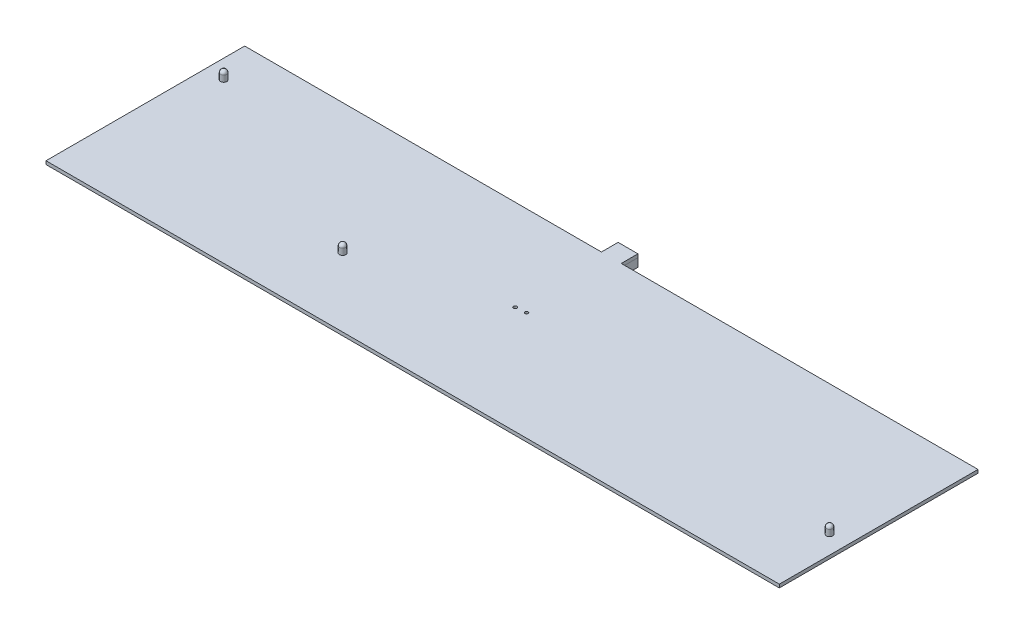
ISO-10303-21;
HEADER;
FILE_DESCRIPTION(('STEP AP214'),'2;1');
FILE_NAME('part.step','',(''),(''),'','','');
FILE_SCHEMA(('AUTOMOTIVE_DESIGN { 1 0 10303 214 1 1 1 1 }'));
ENDSEC;
DATA;
#1=APPLICATION_CONTEXT('core data for automotive mechanical design processes');
#2=APPLICATION_PROTOCOL_DEFINITION('international standard','automotive_design',2000,#1);
#3=PRODUCT_CONTEXT('',#1,'mechanical');
#4=PRODUCT('Part','Part','',(#3));
#5=PRODUCT_RELATED_PRODUCT_CATEGORY('part','',(#4));
#6=PRODUCT_DEFINITION_FORMATION('','',#4);
#7=PRODUCT_DEFINITION_CONTEXT('part definition',#1,'design');
#8=PRODUCT_DEFINITION('design','',#6,#7);
#9=PRODUCT_DEFINITION_SHAPE('','',#8);
#10=(LENGTH_UNIT() NAMED_UNIT(*) SI_UNIT(.MILLI.,.METRE.));
#11=(NAMED_UNIT(*) PLANE_ANGLE_UNIT() SI_UNIT($,.RADIAN.));
#12=(NAMED_UNIT(*) SI_UNIT($,.STERADIAN.) SOLID_ANGLE_UNIT());
#13=UNCERTAINTY_MEASURE_WITH_UNIT(LENGTH_MEASURE(1.E-05),#10,'distance_accuracy_value','');
#14=(GEOMETRIC_REPRESENTATION_CONTEXT(3) GLOBAL_UNCERTAINTY_ASSIGNED_CONTEXT((#13)) GLOBAL_UNIT_ASSIGNED_CONTEXT((#10,
#11,#12)) REPRESENTATION_CONTEXT('',''));
#15=CARTESIAN_POINT('',(0.,0.,0.));
#16=DIRECTION('',(0.,0.,1.));
#17=DIRECTION('',(1.,0.,0.));
#18=AXIS2_PLACEMENT_3D('',#15,#16,#17);
#19=CARTESIAN_POINT('',(4.74999999999994,-5.6,-55.6));
#20=DIRECTION('',(-1.,0.,0.));
#21=DIRECTION('',(0.,0.,1.));
#22=AXIS2_PLACEMENT_3D('',#19,#20,#21);
#23=PLANE('',#22);
#24=DIRECTION('',(0.,0.,1.));
#25=VECTOR('',#24,1.);
#26=CARTESIAN_POINT('',(4.74999999999994,-1.6,-55.6));
#27=LINE('',#26,#25);
#28=CARTESIAN_POINT('',(4.74999999999994,-1.6,-55.6));
#29=VERTEX_POINT('',#28);
#30=CARTESIAN_POINT('',(4.74999999999994,-1.6,-47.6));
#31=VERTEX_POINT('',#30);
#32=EDGE_CURVE('E109',#29,#31,#27,.T.);
#33=ORIENTED_EDGE('',*,*,#32,.T.);
#34=DIRECTION('',(0.,1.,0.));
#35=VECTOR('',#34,1.);
#36=CARTESIAN_POINT('',(4.74999999999994,-5.6,-47.6));
#37=LINE('',#36,#35);
#38=CARTESIAN_POINT('',(4.74999999999994,-5.6,-47.6));
#39=VERTEX_POINT('',#38);
#40=EDGE_CURVE('E12',#39,#31,#37,.T.);
#41=ORIENTED_EDGE('',*,*,#40,.F.);
#42=DIRECTION('',(0.,0.,1.));
#43=VECTOR('',#42,1.);
#44=CARTESIAN_POINT('',(4.74999999999994,-5.6,-55.6));
#45=LINE('',#44,#43);
#46=CARTESIAN_POINT('',(4.74999999999994,-5.6,-55.6));
#47=VERTEX_POINT('',#46);
#48=EDGE_CURVE('E97',#47,#39,#45,.T.);
#49=ORIENTED_EDGE('',*,*,#48,.F.);
#50=DIRECTION('',(0.,1.,0.));
#51=VECTOR('',#50,1.);
#52=CARTESIAN_POINT('',(4.74999999999994,-5.6,-55.6));
#53=LINE('',#52,#51);
#54=EDGE_CURVE('E105',#47,#29,#53,.T.);
#55=ORIENTED_EDGE('',*,*,#54,.T.);
#56=EDGE_LOOP('',(#33,#41,#49,#55));
#57=FACE_BOUND('',#56,.T.);
#58=ADVANCED_FACE('F46',(#57),#23,.F.);
#59=CARTESIAN_POINT('',(4.74999999999994,-5.6,-47.6));
#60=DIRECTION('',(0.,0.,-1.));
#61=DIRECTION('',(0.,1.,0.));
#62=AXIS2_PLACEMENT_3D('',#59,#60,#61);
#63=PLANE('',#62);
#64=DIRECTION('',(-1.,0.,0.));
#65=VECTOR('',#64,1.);
#66=CARTESIAN_POINT('',(4.74999999999994,-1.6,-47.6));
#67=LINE('',#66,#65);
#68=CARTESIAN_POINT('',(-4.75000000000006,-1.6,-47.6));
#69=VERTEX_POINT('',#68);
#70=EDGE_CURVE('E101',#31,#69,#67,.T.);
#71=ORIENTED_EDGE('',*,*,#70,.T.);
#72=DIRECTION('',(0.,1.,0.));
#73=VECTOR('',#72,1.);
#74=CARTESIAN_POINT('',(-4.75000000000006,-5.6,-47.6));
#75=LINE('',#74,#73);
#76=CARTESIAN_POINT('',(-4.75000000000006,-5.6,-47.6));
#77=VERTEX_POINT('',#76);
#78=EDGE_CURVE('E54',#77,#69,#75,.T.);
#79=ORIENTED_EDGE('',*,*,#78,.F.);
#80=DIRECTION('',(-1.,0.,0.));
#81=VECTOR('',#80,1.);
#82=CARTESIAN_POINT('',(4.74999999999994,-5.6,-47.6));
#83=LINE('',#82,#81);
#84=EDGE_CURVE('E92',#39,#77,#83,.T.);
#85=ORIENTED_EDGE('',*,*,#84,.F.);
#86=ORIENTED_EDGE('',*,*,#40,.T.);
#87=EDGE_LOOP('',(#71,#79,#85,#86));
#88=FACE_BOUND('',#87,.T.);
#89=ADVANCED_FACE('F100',(#88),#63,.F.);
#90=CARTESIAN_POINT('',(-4.75000000000006,-5.6,-47.6));
#91=DIRECTION('',(1.,0.,0.));
#92=DIRECTION('',(0.,0.,-1.));
#93=AXIS2_PLACEMENT_3D('',#90,#91,#92);
#94=PLANE('',#93);
#95=DIRECTION('',(0.,0.,-1.));
#96=VECTOR('',#95,1.);
#97=CARTESIAN_POINT('',(-4.75000000000006,-1.6,-47.6));
#98=LINE('',#97,#96);
#99=CARTESIAN_POINT('',(-4.75000000000006,-1.6,-55.6));
#100=VERTEX_POINT('',#99);
#101=EDGE_CURVE('E79',#69,#100,#98,.T.);
#102=ORIENTED_EDGE('',*,*,#101,.T.);
#103=DIRECTION('',(0.,1.,0.));
#104=VECTOR('',#103,1.);
#105=CARTESIAN_POINT('',(-4.75000000000006,-5.6,-55.6));
#106=LINE('',#105,#104);
#107=CARTESIAN_POINT('',(-4.75000000000006,-5.6,-55.6));
#108=VERTEX_POINT('',#107);
#109=EDGE_CURVE('E102',#108,#100,#106,.T.);
#110=ORIENTED_EDGE('',*,*,#109,.F.);
#111=DIRECTION('',(0.,0.,-1.));
#112=VECTOR('',#111,1.);
#113=CARTESIAN_POINT('',(-4.75000000000006,-5.6,-47.6));
#114=LINE('',#113,#112);
#115=EDGE_CURVE('E95',#77,#108,#114,.T.);
#116=ORIENTED_EDGE('',*,*,#115,.F.);
#117=ORIENTED_EDGE('',*,*,#78,.T.);
#118=EDGE_LOOP('',(#102,#110,#116,#117));
#119=FACE_BOUND('',#118,.T.);
#120=ADVANCED_FACE('F103',(#119),#94,.F.);
#121=CARTESIAN_POINT('',(-4.75000000000006,-5.6,-55.6));
#122=DIRECTION('',(0.,0.,1.));
#123=DIRECTION('',(0.,-1.,0.));
#124=AXIS2_PLACEMENT_3D('',#121,#122,#123);
#125=PLANE('',#124);
#126=DIRECTION('',(1.,0.,0.));
#127=VECTOR('',#126,1.);
#128=CARTESIAN_POINT('',(-4.75000000000006,-1.6,-55.6));
#129=LINE('',#128,#127);
#130=EDGE_CURVE('E85',#100,#29,#129,.T.);
#131=ORIENTED_EDGE('',*,*,#130,.T.);
#132=ORIENTED_EDGE('',*,*,#54,.F.);
#133=DIRECTION('',(1.,0.,0.));
#134=VECTOR('',#133,1.);
#135=CARTESIAN_POINT('',(-4.75000000000006,-5.6,-55.6));
#136=LINE('',#135,#134);
#137=EDGE_CURVE('E62',#108,#47,#136,.T.);
#138=ORIENTED_EDGE('',*,*,#137,.F.);
#139=ORIENTED_EDGE('',*,*,#109,.T.);
#140=EDGE_LOOP('',(#131,#132,#138,#139));
#141=FACE_BOUND('',#140,.T.);
#142=ADVANCED_FACE('F116',(#141),#125,.F.);
#143=CARTESIAN_POINT('',(0.,-5.6,0.));
#144=DIRECTION('',(0.,-1.,0.));
#145=DIRECTION('',(0.,0.,-1.));
#146=AXIS2_PLACEMENT_3D('',#143,#144,#145);
#147=PLANE('',#146);
#148=ORIENTED_EDGE('',*,*,#48,.T.);
#149=ORIENTED_EDGE('',*,*,#84,.T.);
#150=ORIENTED_EDGE('',*,*,#115,.T.);
#151=ORIENTED_EDGE('',*,*,#137,.T.);
#152=EDGE_LOOP('',(#148,#149,#150,#151));
#153=FACE_BOUND('',#152,.T.);
#154=ADVANCED_FACE('F93',(#153),#147,.T.);
#155=CARTESIAN_POINT('',(0.,-1.6,0.));
#156=DIRECTION('',(0.,-1.,0.));
#157=DIRECTION('',(0.,0.,-1.));
#158=AXIS2_PLACEMENT_3D('',#155,#156,#157);
#159=PLANE('',#158);
#160=ORIENTED_EDGE('',*,*,#32,.F.);
#161=ORIENTED_EDGE('',*,*,#130,.F.);
#162=ORIENTED_EDGE('',*,*,#101,.F.);
#163=ORIENTED_EDGE('',*,*,#70,.F.);
#164=EDGE_LOOP('',(#160,#161,#162,#163));
#165=FACE_BOUND('',#164,.T.);
#166=ADVANCED_FACE('F119',(#165),#159,.F.);
#167=CLOSED_SHELL('',(#58,#89,#120,#142,#154,#166));
#168=MANIFOLD_SOLID_BREP('B2',#167);
#169=CARTESIAN_POINT('',(4.74999999999994,-1.6,-47.6));
#170=DIRECTION('',(0.,0.,-1.));
#171=DIRECTION('',(-1.,0.,0.));
#172=AXIS2_PLACEMENT_3D('',#169,#170,#171);
#173=PLANE('',#172);
#174=DIRECTION('',(-1.,0.,0.));
#175=VECTOR('',#174,1.);
#176=CARTESIAN_POINT('',(4.74999999999994,0.,-47.6));
#177=LINE('',#176,#175);
#178=CARTESIAN_POINT('',(175.7,0.,-47.6));
#179=VERTEX_POINT('',#178);
#180=CARTESIAN_POINT('',(4.74999999999994,0.,-47.6));
#181=VERTEX_POINT('',#180);
#182=EDGE_CURVE('E270',#179,#181,#177,.T.);
#183=ORIENTED_EDGE('',*,*,#182,.F.);
#184=DIRECTION('',(0.,1.,0.));
#185=VECTOR('',#184,1.);
#186=CARTESIAN_POINT('',(175.7,-1.6,-47.6));
#187=LINE('',#186,#185);
#188=CARTESIAN_POINT('',(175.7,-1.6,-47.6));
#189=VERTEX_POINT('',#188);
#190=EDGE_CURVE('E44',#189,#179,#187,.T.);
#191=ORIENTED_EDGE('',*,*,#190,.F.);
#192=DIRECTION('',(-1.,0.,0.));
#193=VECTOR('',#192,1.);
#194=CARTESIAN_POINT('',(4.74999999999994,-1.6,-47.6));
#195=LINE('',#194,#193);
#196=CARTESIAN_POINT('',(4.74999999999994,-1.6,-47.6));
#197=VERTEX_POINT('',#196);
#198=EDGE_CURVE('E291',#189,#197,#195,.T.);
#199=ORIENTED_EDGE('',*,*,#198,.T.);
#200=DIRECTION('',(0.,1.,0.));
#201=VECTOR('',#200,1.);
#202=CARTESIAN_POINT('',(4.74999999999994,-1.6,-47.6));
#203=LINE('',#202,#201);
#204=EDGE_CURVE('E228',#197,#181,#203,.T.);
#205=ORIENTED_EDGE('',*,*,#204,.T.);
#206=EDGE_LOOP('',(#183,#191,#199,#205));
#207=FACE_BOUND('',#206,.T.);
#208=ADVANCED_FACE('F171',(#207),#173,.T.);
#209=CARTESIAN_POINT('',(175.7,-1.6,47.6));
#210=DIRECTION('',(1.,0.,0.));
#211=DIRECTION('',(0.,0.,-1.));
#212=AXIS2_PLACEMENT_3D('',#209,#210,#211);
#213=PLANE('',#212);
#214=DIRECTION('',(0.,0.,-1.));
#215=VECTOR('',#214,1.);
#216=CARTESIAN_POINT('',(175.7,0.,47.6));
#217=LINE('',#216,#215);
#218=CARTESIAN_POINT('',(175.7,0.,47.6));
#219=VERTEX_POINT('',#218);
#220=EDGE_CURVE('E289',#219,#179,#217,.T.);
#221=ORIENTED_EDGE('',*,*,#220,.F.);
#222=DIRECTION('',(0.,1.,0.));
#223=VECTOR('',#222,1.);
#224=CARTESIAN_POINT('',(175.7,-1.6,47.6));
#225=LINE('',#224,#223);
#226=CARTESIAN_POINT('',(175.7,-1.6,47.6));
#227=VERTEX_POINT('',#226);
#228=EDGE_CURVE('E181',#227,#219,#225,.T.);
#229=ORIENTED_EDGE('',*,*,#228,.F.);
#230=DIRECTION('',(0.,0.,-1.));
#231=VECTOR('',#230,1.);
#232=CARTESIAN_POINT('',(175.7,-1.6,47.6));
#233=LINE('',#232,#231);
#234=EDGE_CURVE('E260',#227,#189,#233,.T.);
#235=ORIENTED_EDGE('',*,*,#234,.T.);
#236=ORIENTED_EDGE('',*,*,#190,.T.);
#237=EDGE_LOOP('',(#221,#229,#235,#236));
#238=FACE_BOUND('',#237,.T.);
#239=ADVANCED_FACE('F349',(#238),#213,.T.);
#240=CARTESIAN_POINT('',(-175.7,-1.6,47.6));
#241=DIRECTION('',(0.,0.,1.));
#242=DIRECTION('',(1.,0.,0.));
#243=AXIS2_PLACEMENT_3D('',#240,#241,#242);
#244=PLANE('',#243);
#245=DIRECTION('',(1.,0.,0.));
#246=VECTOR('',#245,1.);
#247=CARTESIAN_POINT('',(-175.7,0.,47.6));
#248=LINE('',#247,#246);
#249=CARTESIAN_POINT('',(-175.7,0.,47.6));
#250=VERTEX_POINT('',#249);
#251=EDGE_CURVE('E247',#250,#219,#248,.T.);
#252=ORIENTED_EDGE('',*,*,#251,.F.);
#253=DIRECTION('',(0.,1.,0.));
#254=VECTOR('',#253,1.);
#255=CARTESIAN_POINT('',(-175.7,-1.6,47.6));
#256=LINE('',#255,#254);
#257=CARTESIAN_POINT('',(-175.7,-1.6,47.6));
#258=VERTEX_POINT('',#257);
#259=EDGE_CURVE('E242',#258,#250,#256,.T.);
#260=ORIENTED_EDGE('',*,*,#259,.F.);
#261=DIRECTION('',(1.,0.,0.));
#262=VECTOR('',#261,1.);
#263=CARTESIAN_POINT('',(-175.7,-1.6,47.6));
#264=LINE('',#263,#262);
#265=EDGE_CURVE('E245',#258,#227,#264,.T.);
#266=ORIENTED_EDGE('',*,*,#265,.T.);
#267=ORIENTED_EDGE('',*,*,#228,.T.);
#268=EDGE_LOOP('',(#252,#260,#266,#267));
#269=FACE_BOUND('',#268,.T.);
#270=ADVANCED_FACE('F244',(#269),#244,.T.);
#271=CARTESIAN_POINT('',(-175.7,-1.6,47.6));
#272=DIRECTION('',(-1.,0.,0.));
#273=DIRECTION('',(0.,0.,1.));
#274=AXIS2_PLACEMENT_3D('',#271,#272,#273);
#275=PLANE('',#274);
#276=DIRECTION('',(0.,0.,1.));
#277=VECTOR('',#276,1.);
#278=CARTESIAN_POINT('',(-175.7,0.,47.6));
#279=LINE('',#278,#277);
#280=CARTESIAN_POINT('',(-175.7,0.,-47.6));
#281=VERTEX_POINT('',#280);
#282=EDGE_CURVE('E286',#281,#250,#279,.T.);
#283=ORIENTED_EDGE('',*,*,#282,.F.);
#284=DIRECTION('',(0.,1.,0.));
#285=VECTOR('',#284,1.);
#286=CARTESIAN_POINT('',(-175.7,-1.6,-47.6));
#287=LINE('',#286,#285);
#288=CARTESIAN_POINT('',(-175.7,-1.6,-47.6));
#289=VERTEX_POINT('',#288);
#290=EDGE_CURVE('E252',#289,#281,#287,.T.);
#291=ORIENTED_EDGE('',*,*,#290,.F.);
#292=DIRECTION('',(0.,0.,1.));
#293=VECTOR('',#292,1.);
#294=CARTESIAN_POINT('',(-175.7,-1.6,47.6));
#295=LINE('',#294,#293);
#296=EDGE_CURVE('E258',#289,#258,#295,.T.);
#297=ORIENTED_EDGE('',*,*,#296,.T.);
#298=ORIENTED_EDGE('',*,*,#259,.T.);
#299=EDGE_LOOP('',(#283,#291,#297,#298));
#300=FACE_BOUND('',#299,.T.);
#301=ADVANCED_FACE('F262',(#300),#275,.T.);
#302=CARTESIAN_POINT('',(-175.7,-1.6,-47.6));
#303=DIRECTION('',(0.,0.,-1.));
#304=DIRECTION('',(-1.,0.,0.));
#305=AXIS2_PLACEMENT_3D('',#302,#303,#304);
#306=PLANE('',#305);
#307=DIRECTION('',(-1.,0.,0.));
#308=VECTOR('',#307,1.);
#309=CARTESIAN_POINT('',(-175.7,0.,-47.6));
#310=LINE('',#309,#308);
#311=CARTESIAN_POINT('',(-4.75000000000006,0.,-47.6));
#312=VERTEX_POINT('',#311);
#313=EDGE_CURVE('E283',#312,#281,#310,.T.);
#314=ORIENTED_EDGE('',*,*,#313,.F.);
#315=DIRECTION('',(0.,1.,0.));
#316=VECTOR('',#315,1.);
#317=CARTESIAN_POINT('',(-4.75000000000006,-1.6,-47.6));
#318=LINE('',#317,#316);
#319=CARTESIAN_POINT('',(-4.75000000000006,-1.6,-47.6));
#320=VERTEX_POINT('',#319);
#321=EDGE_CURVE('E295',#320,#312,#318,.T.);
#322=ORIENTED_EDGE('',*,*,#321,.F.);
#323=DIRECTION('',(-1.,0.,0.));
#324=VECTOR('',#323,1.);
#325=CARTESIAN_POINT('',(-175.7,-1.6,-47.6));
#326=LINE('',#325,#324);
#327=EDGE_CURVE('E263',#320,#289,#326,.T.);
#328=ORIENTED_EDGE('',*,*,#327,.T.);
#329=ORIENTED_EDGE('',*,*,#290,.T.);
#330=EDGE_LOOP('',(#314,#322,#328,#329));
#331=FACE_BOUND('',#330,.T.);
#332=ADVANCED_FACE('F363',(#331),#306,.T.);
#333=CARTESIAN_POINT('',(-4.75000000000006,-1.6,-47.6));
#334=DIRECTION('',(-1.,0.,0.));
#335=DIRECTION('',(0.,0.,1.));
#336=AXIS2_PLACEMENT_3D('',#333,#334,#335);
#337=PLANE('',#336);
#338=DIRECTION('',(0.,0.,1.));
#339=VECTOR('',#338,1.);
#340=CARTESIAN_POINT('',(-4.75000000000006,0.,-47.6));
#341=LINE('',#340,#339);
#342=CARTESIAN_POINT('',(-4.75000000000006,0.,-55.6));
#343=VERTEX_POINT('',#342);
#344=EDGE_CURVE('E280',#343,#312,#341,.T.);
#345=ORIENTED_EDGE('',*,*,#344,.F.);
#346=DIRECTION('',(0.,1.,0.));
#347=VECTOR('',#346,1.);
#348=CARTESIAN_POINT('',(-4.75000000000006,-1.6,-55.6));
#349=LINE('',#348,#347);
#350=CARTESIAN_POINT('',(-4.75000000000006,-1.6,-55.6));
#351=VERTEX_POINT('',#350);
#352=EDGE_CURVE('E297',#351,#343,#349,.T.);
#353=ORIENTED_EDGE('',*,*,#352,.F.);
#354=DIRECTION('',(0.,0.,1.));
#355=VECTOR('',#354,1.);
#356=CARTESIAN_POINT('',(-4.75000000000006,-1.6,-47.6));
#357=LINE('',#356,#355);
#358=EDGE_CURVE('E265',#351,#320,#357,.T.);
#359=ORIENTED_EDGE('',*,*,#358,.T.);
#360=ORIENTED_EDGE('',*,*,#321,.T.);
#361=EDGE_LOOP('',(#345,#353,#359,#360));
#362=FACE_BOUND('',#361,.T.);
#363=ADVANCED_FACE('F340',(#362),#337,.T.);
#364=CARTESIAN_POINT('',(-4.75000000000006,-1.6,-55.6));
#365=DIRECTION('',(0.,0.,-1.));
#366=DIRECTION('',(-1.,0.,0.));
#367=AXIS2_PLACEMENT_3D('',#364,#365,#366);
#368=PLANE('',#367);
#369=DIRECTION('',(-1.,0.,0.));
#370=VECTOR('',#369,1.);
#371=CARTESIAN_POINT('',(-4.75000000000006,0.,-55.6));
#372=LINE('',#371,#370);
#373=CARTESIAN_POINT('',(4.74999999999994,0.,-55.6));
#374=VERTEX_POINT('',#373);
#375=EDGE_CURVE('E277',#374,#343,#372,.T.);
#376=ORIENTED_EDGE('',*,*,#375,.F.);
#377=DIRECTION('',(0.,1.,0.));
#378=VECTOR('',#377,1.);
#379=CARTESIAN_POINT('',(4.74999999999994,-1.6,-55.6));
#380=LINE('',#379,#378);
#381=CARTESIAN_POINT('',(4.74999999999994,-1.6,-55.6));
#382=VERTEX_POINT('',#381);
#383=EDGE_CURVE('E299',#382,#374,#380,.T.);
#384=ORIENTED_EDGE('',*,*,#383,.F.);
#385=DIRECTION('',(-1.,0.,0.));
#386=VECTOR('',#385,1.);
#387=CARTESIAN_POINT('',(-4.75000000000006,-1.6,-55.6));
#388=LINE('',#387,#386);
#389=EDGE_CURVE('E334',#382,#351,#388,.T.);
#390=ORIENTED_EDGE('',*,*,#389,.T.);
#391=ORIENTED_EDGE('',*,*,#352,.T.);
#392=EDGE_LOOP('',(#376,#384,#390,#391));
#393=FACE_BOUND('',#392,.T.);
#394=ADVANCED_FACE('F345',(#393),#368,.T.);
#395=CARTESIAN_POINT('',(4.74999999999994,-1.6,-47.6));
#396=DIRECTION('',(1.,0.,0.));
#397=DIRECTION('',(0.,0.,-1.));
#398=AXIS2_PLACEMENT_3D('',#395,#396,#397);
#399=PLANE('',#398);
#400=DIRECTION('',(0.,0.,-1.));
#401=VECTOR('',#400,1.);
#402=CARTESIAN_POINT('',(4.74999999999994,0.,-47.6));
#403=LINE('',#402,#401);
#404=EDGE_CURVE('E273',#181,#374,#403,.T.);
#405=ORIENTED_EDGE('',*,*,#404,.F.);
#406=ORIENTED_EDGE('',*,*,#204,.F.);
#407=DIRECTION('',(0.,0.,-1.));
#408=VECTOR('',#407,1.);
#409=CARTESIAN_POINT('',(4.74999999999994,-1.6,-47.6));
#410=LINE('',#409,#408);
#411=EDGE_CURVE('E332',#197,#382,#410,.T.);
#412=ORIENTED_EDGE('',*,*,#411,.T.);
#413=ORIENTED_EDGE('',*,*,#383,.T.);
#414=EDGE_LOOP('',(#405,#406,#412,#413));
#415=FACE_BOUND('',#414,.T.);
#416=ADVANCED_FACE('F346',(#415),#399,.T.);
#417=CARTESIAN_POINT('',(0.,-1.6,0.));
#418=DIRECTION('',(0.,1.,0.));
#419=DIRECTION('',(0.,0.,1.));
#420=AXIS2_PLACEMENT_3D('',#417,#418,#419);
#421=PLANE('',#420);
#422=CARTESIAN_POINT('',(-2.5,-1.6,-4.));
#423=DIRECTION('',(0.,1.,0.));
#424=DIRECTION('',(0.,0.,1.));
#425=AXIS2_PLACEMENT_3D('',#422,#423,#424);
#426=CIRCLE('',#425,0.814910184363254);
#427=CARTESIAN_POINT('',(-2.5,-1.6,-3.18508981563675));
#428=VERTEX_POINT('',#427);
#429=EDGE_CURVE('E321',#428,#428,#426,.T.);
#430=ORIENTED_EDGE('',*,*,#429,.T.);
#431=EDGE_LOOP('',(#430));
#432=FACE_BOUND('',#431,.T.);
#433=CARTESIAN_POINT('',(2.5,-1.6,-4.5));
#434=DIRECTION('',(0.,1.,0.));
#435=DIRECTION('',(0.,0.,1.));
#436=AXIS2_PLACEMENT_3D('',#433,#434,#435);
#437=CIRCLE('',#436,0.733267679987911);
#438=CARTESIAN_POINT('',(2.5,-1.6,-3.76673232001209));
#439=VERTEX_POINT('',#438);
#440=EDGE_CURVE('E274',#439,#439,#437,.T.);
#441=ORIENTED_EDGE('',*,*,#440,.T.);
#442=EDGE_LOOP('',(#441));
#443=FACE_BOUND('',#442,.T.);
#444=ORIENTED_EDGE('',*,*,#198,.F.);
#445=ORIENTED_EDGE('',*,*,#234,.F.);
#446=ORIENTED_EDGE('',*,*,#265,.F.);
#447=ORIENTED_EDGE('',*,*,#296,.F.);
#448=ORIENTED_EDGE('',*,*,#327,.F.);
#449=ORIENTED_EDGE('',*,*,#358,.F.);
#450=ORIENTED_EDGE('',*,*,#389,.F.);
#451=ORIENTED_EDGE('',*,*,#411,.F.);
#452=EDGE_LOOP('',(#444,#445,#446,#447,#448,#449,#450,#451));
#453=FACE_BOUND('',#452,.T.);
#454=ADVANCED_FACE('F256',(#432,#443,#453),#421,.F.);
#455=CARTESIAN_POINT('',(0.,0.,0.));
#456=DIRECTION('',(0.,1.,0.));
#457=DIRECTION('',(0.,0.,1.));
#458=AXIS2_PLACEMENT_3D('',#455,#456,#457);
#459=PLANE('',#458);
#460=CARTESIAN_POINT('',(166.981249999994,0.,14.7999999999999));
#461=DIRECTION('',(0.,1.,0.));
#462=DIRECTION('',(0.,0.,1.));
#463=AXIS2_PLACEMENT_3D('',#460,#461,#462);
#464=CIRCLE('',#463,1.5);
#465=CARTESIAN_POINT('',(166.981249999994,0.,16.2999999999999));
#466=VERTEX_POINT('',#465);
#467=EDGE_CURVE('E318',#466,#466,#464,.T.);
#468=ORIENTED_EDGE('',*,*,#467,.F.);
#469=EDGE_LOOP('',(#468));
#470=FACE_BOUND('',#469,.T.);
#471=CARTESIAN_POINT('',(-66.381250000005,0.,14.7999999999999));
#472=DIRECTION('',(0.,1.,0.));
#473=DIRECTION('',(0.,0.,1.));
#474=AXIS2_PLACEMENT_3D('',#471,#472,#473);
#475=CIRCLE('',#474,1.5);
#476=CARTESIAN_POINT('',(-66.381250000005,0.,16.2999999999999));
#477=VERTEX_POINT('',#476);
#478=EDGE_CURVE('E308',#477,#477,#475,.T.);
#479=ORIENTED_EDGE('',*,*,#478,.F.);
#480=EDGE_LOOP('',(#479));
#481=FACE_BOUND('',#480,.T.);
#482=CARTESIAN_POINT('',(-166.737500000004,0.,-28.5750000000002));
#483=DIRECTION('',(0.,1.,0.));
#484=DIRECTION('',(0.,0.,1.));
#485=AXIS2_PLACEMENT_3D('',#482,#483,#484);
#486=CIRCLE('',#485,1.5);
#487=CARTESIAN_POINT('',(-166.737500000004,0.,-27.0750000000002));
#488=VERTEX_POINT('',#487);
#489=EDGE_CURVE('E305',#488,#488,#486,.T.);
#490=ORIENTED_EDGE('',*,*,#489,.F.);
#491=EDGE_LOOP('',(#490));
#492=FACE_BOUND('',#491,.T.);
#493=CARTESIAN_POINT('',(-2.5,0.,-4.));
#494=DIRECTION('',(0.,1.,0.));
#495=DIRECTION('',(0.,0.,1.));
#496=AXIS2_PLACEMENT_3D('',#493,#494,#495);
#497=CIRCLE('',#496,0.814910184363254);
#498=CARTESIAN_POINT('',(-2.5,0.,-3.18508981563675));
#499=VERTEX_POINT('',#498);
#500=EDGE_CURVE('E304',#499,#499,#497,.T.);
#501=ORIENTED_EDGE('',*,*,#500,.F.);
#502=EDGE_LOOP('',(#501));
#503=FACE_BOUND('',#502,.T.);
#504=CARTESIAN_POINT('',(2.5,0.,-4.5));
#505=DIRECTION('',(0.,1.,0.));
#506=DIRECTION('',(0.,0.,1.));
#507=AXIS2_PLACEMENT_3D('',#504,#505,#506);
#508=CIRCLE('',#507,0.733267679987911);
#509=CARTESIAN_POINT('',(2.5,0.,-3.76673232001209));
#510=VERTEX_POINT('',#509);
#511=EDGE_CURVE('E324',#510,#510,#508,.T.);
#512=ORIENTED_EDGE('',*,*,#511,.F.);
#513=EDGE_LOOP('',(#512));
#514=FACE_BOUND('',#513,.T.);
#515=ORIENTED_EDGE('',*,*,#182,.T.);
#516=ORIENTED_EDGE('',*,*,#404,.T.);
#517=ORIENTED_EDGE('',*,*,#375,.T.);
#518=ORIENTED_EDGE('',*,*,#344,.T.);
#519=ORIENTED_EDGE('',*,*,#313,.T.);
#520=ORIENTED_EDGE('',*,*,#282,.T.);
#521=ORIENTED_EDGE('',*,*,#251,.T.);
#522=ORIENTED_EDGE('',*,*,#220,.T.);
#523=EDGE_LOOP('',(#515,#516,#517,#518,#519,#520,#521,#522));
#524=FACE_BOUND('',#523,.T.);
#525=ADVANCED_FACE('F348',(#470,#481,#492,#503,#514,#524),#459,.T.);
#526=CARTESIAN_POINT('',(2.5,-1.6,-4.5));
#527=DIRECTION('',(0.,1.,0.));
#528=DIRECTION('',(0.,0.,1.));
#529=AXIS2_PLACEMENT_3D('',#526,#527,#528);
#530=CYLINDRICAL_SURFACE('',#529,0.733267679987911);
#531=ORIENTED_EDGE('',*,*,#440,.F.);
#532=EDGE_LOOP('',(#531));
#533=FACE_BOUND('',#532,.T.);
#534=ORIENTED_EDGE('',*,*,#511,.T.);
#535=EDGE_LOOP('',(#534));
#536=FACE_BOUND('',#535,.T.);
#537=ADVANCED_FACE('F398',(#533,#536),#530,.F.);
#538=CARTESIAN_POINT('',(-2.5,-1.6,-4.));
#539=DIRECTION('',(0.,1.,0.));
#540=DIRECTION('',(0.,0.,1.));
#541=AXIS2_PLACEMENT_3D('',#538,#539,#540);
#542=CYLINDRICAL_SURFACE('',#541,0.814910184363254);
#543=ORIENTED_EDGE('',*,*,#429,.F.);
#544=EDGE_LOOP('',(#543));
#545=FACE_BOUND('',#544,.T.);
#546=ORIENTED_EDGE('',*,*,#500,.T.);
#547=EDGE_LOOP('',(#546));
#548=FACE_BOUND('',#547,.T.);
#549=ADVANCED_FACE('F394',(#545,#548),#542,.F.);
#550=CARTESIAN_POINT('',(-166.737500000004,3.,-28.5750000000002));
#551=DIRECTION('',(0.,-1.,0.));
#552=DIRECTION('',(0.,0.,-1.));
#553=AXIS2_PLACEMENT_3D('',#550,#551,#552);
#554=CYLINDRICAL_SURFACE('',#553,1.5);
#555=CARTESIAN_POINT('',(-166.737500000004,3.,-28.5750000000002));
#556=DIRECTION('',(0.,1.,0.));
#557=DIRECTION('',(0.,0.,1.));
#558=AXIS2_PLACEMENT_3D('',#555,#556,#557);
#559=CIRCLE('',#558,1.5);
#560=CARTESIAN_POINT('',(-166.737500000004,3.,-27.0750000000002));
#561=VERTEX_POINT('',#560);
#562=EDGE_CURVE('E302',#561,#561,#559,.T.);
#563=ORIENTED_EDGE('',*,*,#562,.F.);
#564=EDGE_LOOP('',(#563));
#565=FACE_BOUND('',#564,.T.);
#566=ORIENTED_EDGE('',*,*,#489,.T.);
#567=EDGE_LOOP('',(#566));
#568=FACE_BOUND('',#567,.T.);
#569=ADVANCED_FACE('F376',(#565,#568),#554,.T.);
#570=CARTESIAN_POINT('',(-166.737500000004,3.,-28.5750000000002));
#571=DIRECTION('',(0.,0.,1.));
#572=DIRECTION('',(1.,0.,0.));
#573=AXIS2_PLACEMENT_3D('',#570,#571,#572);
#574=SPHERICAL_SURFACE('',#573,1.5);
#575=CARTESIAN_POINT('',(-166.737500000004,3.,-28.5750000000002));
#576=DIRECTION('',(0.,1.,0.));
#577=DIRECTION('',(0.,0.,1.));
#578=AXIS2_PLACEMENT_3D('',#575,#576,#577);
#579=SPHERICAL_SURFACE('',#578,1.5);
#580=ORIENTED_EDGE('',*,*,#562,.T.);
#581=EDGE_LOOP('',(#580));
#582=FACE_BOUND('',#581,.T.);
#583=ADVANCED_FACE('F373',(#582),#579,.T.);
#584=CARTESIAN_POINT('',(-66.381250000005,3.,14.7999999999999));
#585=DIRECTION('',(0.,-1.,0.));
#586=DIRECTION('',(0.,0.,-1.));
#587=AXIS2_PLACEMENT_3D('',#584,#585,#586);
#588=CYLINDRICAL_SURFACE('',#587,1.5);
#589=CARTESIAN_POINT('',(-66.381250000005,3.,14.7999999999999));
#590=DIRECTION('',(0.,1.,0.));
#591=DIRECTION('',(0.,0.,1.));
#592=AXIS2_PLACEMENT_3D('',#589,#590,#591);
#593=CIRCLE('',#592,1.5);
#594=CARTESIAN_POINT('',(-66.381250000005,3.,16.2999999999999));
#595=VERTEX_POINT('',#594);
#596=EDGE_CURVE('E306',#595,#595,#593,.T.);
#597=ORIENTED_EDGE('',*,*,#596,.F.);
#598=EDGE_LOOP('',(#597));
#599=FACE_BOUND('',#598,.T.);
#600=ORIENTED_EDGE('',*,*,#478,.T.);
#601=EDGE_LOOP('',(#600));
#602=FACE_BOUND('',#601,.T.);
#603=ADVANCED_FACE('F375',(#599,#602),#588,.T.);
#604=CARTESIAN_POINT('',(-66.381250000005,3.,14.7999999999999));
#605=DIRECTION('',(0.,0.,1.));
#606=DIRECTION('',(1.,0.,0.));
#607=AXIS2_PLACEMENT_3D('',#604,#605,#606);
#608=SPHERICAL_SURFACE('',#607,1.5);
#609=CARTESIAN_POINT('',(-66.381250000005,3.,14.7999999999999));
#610=DIRECTION('',(0.,1.,0.));
#611=DIRECTION('',(0.,0.,1.));
#612=AXIS2_PLACEMENT_3D('',#609,#610,#611);
#613=SPHERICAL_SURFACE('',#612,1.5);
#614=ORIENTED_EDGE('',*,*,#596,.T.);
#615=EDGE_LOOP('',(#614));
#616=FACE_BOUND('',#615,.T.);
#617=ADVANCED_FACE('F378',(#616),#613,.T.);
#618=CARTESIAN_POINT('',(166.981249999994,3.,14.7999999999999));
#619=DIRECTION('',(0.,-1.,0.));
#620=DIRECTION('',(0.,0.,-1.));
#621=AXIS2_PLACEMENT_3D('',#618,#619,#620);
#622=CYLINDRICAL_SURFACE('',#621,1.5);
#623=CARTESIAN_POINT('',(166.981249999994,3.,14.7999999999999));
#624=DIRECTION('',(0.,1.,0.));
#625=DIRECTION('',(0.,0.,1.));
#626=AXIS2_PLACEMENT_3D('',#623,#624,#625);
#627=CIRCLE('',#626,1.5);
#628=CARTESIAN_POINT('',(166.981249999994,3.,16.2999999999999));
#629=VERTEX_POINT('',#628);
#630=EDGE_CURVE('E175',#629,#629,#627,.T.);
#631=ORIENTED_EDGE('',*,*,#630,.F.);
#632=EDGE_LOOP('',(#631));
#633=FACE_BOUND('',#632,.T.);
#634=ORIENTED_EDGE('',*,*,#467,.T.);
#635=EDGE_LOOP('',(#634));
#636=FACE_BOUND('',#635,.T.);
#637=ADVANCED_FACE('F380',(#633,#636),#622,.T.);
#638=CARTESIAN_POINT('',(166.981249999994,3.,14.7999999999999));
#639=DIRECTION('',(0.,0.,1.));
#640=DIRECTION('',(1.,0.,0.));
#641=AXIS2_PLACEMENT_3D('',#638,#639,#640);
#642=SPHERICAL_SURFACE('',#641,1.5);
#643=CARTESIAN_POINT('',(166.981249999994,3.,14.7999999999999));
#644=DIRECTION('',(0.,1.,0.));
#645=DIRECTION('',(0.,0.,1.));
#646=AXIS2_PLACEMENT_3D('',#643,#644,#645);
#647=SPHERICAL_SURFACE('',#646,1.5);
#648=ORIENTED_EDGE('',*,*,#630,.T.);
#649=EDGE_LOOP('',(#648));
#650=FACE_BOUND('',#649,.T.);
#651=ADVANCED_FACE('F173',(#650),#647,.T.);
#652=CLOSED_SHELL('',(#208,#239,#270,#301,#332,#363,#394,#416,#454,#525,#537,#549,#569,#583,
#603,#617,#637,#651));
#653=MANIFOLD_SOLID_BREP('B6',#652);
#654=ADVANCED_BREP_SHAPE_REPRESENTATION('',(#18,#168,#653),#14);
#655=SHAPE_DEFINITION_REPRESENTATION(#9,#654);
ENDSEC;
END-ISO-10303-21;
